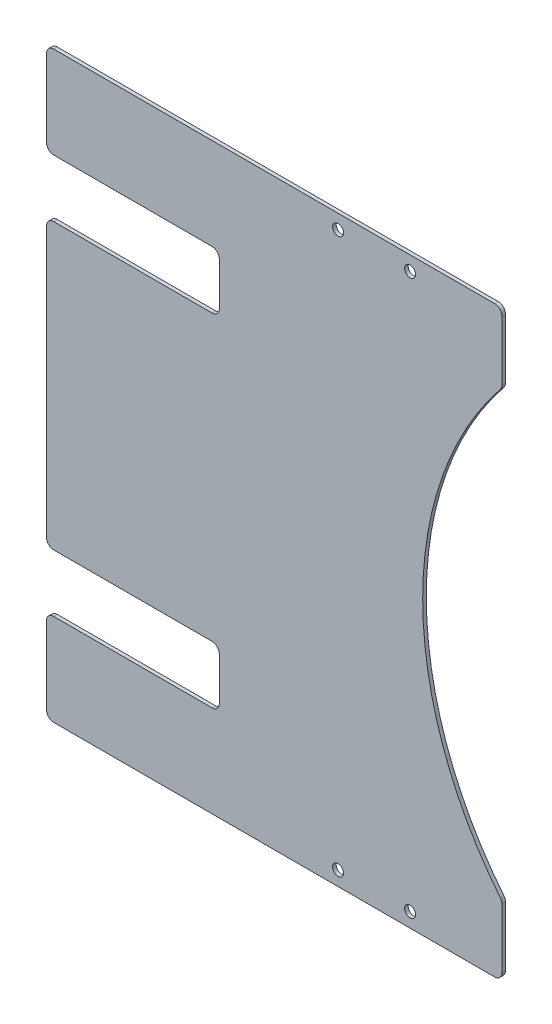
ISO-10303-21;
HEADER;
FILE_DESCRIPTION(('STEP AP214'),'2;1');
FILE_NAME('part.step','',(''),(''),'','','');
FILE_SCHEMA(('AUTOMOTIVE_DESIGN { 1 0 10303 214 1 1 1 1 }'));
ENDSEC;
DATA;
#1=APPLICATION_CONTEXT('core data for automotive mechanical design processes');
#2=APPLICATION_PROTOCOL_DEFINITION('international standard','automotive_design',2000,#1);
#3=PRODUCT_CONTEXT('',#1,'mechanical');
#4=PRODUCT('Part','Part','',(#3));
#5=PRODUCT_RELATED_PRODUCT_CATEGORY('part','',(#4));
#6=PRODUCT_DEFINITION_FORMATION('','',#4);
#7=PRODUCT_DEFINITION_CONTEXT('part definition',#1,'design');
#8=PRODUCT_DEFINITION('design','',#6,#7);
#9=PRODUCT_DEFINITION_SHAPE('','',#8);
#10=(LENGTH_UNIT() NAMED_UNIT(*) SI_UNIT(.MILLI.,.METRE.));
#11=(NAMED_UNIT(*) PLANE_ANGLE_UNIT() SI_UNIT($,.RADIAN.));
#12=(NAMED_UNIT(*) SI_UNIT($,.STERADIAN.) SOLID_ANGLE_UNIT());
#13=UNCERTAINTY_MEASURE_WITH_UNIT(LENGTH_MEASURE(1.E-05),#10,'distance_accuracy_value','');
#14=(GEOMETRIC_REPRESENTATION_CONTEXT(3) GLOBAL_UNCERTAINTY_ASSIGNED_CONTEXT((#13)) GLOBAL_UNIT_ASSIGNED_CONTEXT((#10,
#11,#12)) REPRESENTATION_CONTEXT('',''));
#15=CARTESIAN_POINT('',(0.,0.,0.));
#16=DIRECTION('',(0.,0.,1.));
#17=DIRECTION('',(1.,0.,0.));
#18=AXIS2_PLACEMENT_3D('',#15,#16,#17);
#19=CARTESIAN_POINT('',(35.5,-81.,1.));
#20=DIRECTION('',(-1.,0.,0.));
#21=DIRECTION('',(0.,0.,1.));
#22=AXIS2_PLACEMENT_3D('',#19,#20,#21);
#23=PLANE('',#22);
#24=DIRECTION('',(0.,1.,0.));
#25=VECTOR('',#24,1.);
#26=CARTESIAN_POINT('',(35.5,-81.,0.));
#27=LINE('',#26,#25);
#28=CARTESIAN_POINT('',(35.5,62.4019230472905,0.));
#29=VERTEX_POINT('',#28);
#30=CARTESIAN_POINT('',(35.5,79.,0.));
#31=VERTEX_POINT('',#30);
#32=EDGE_CURVE('E253',#29,#31,#27,.T.);
#33=ORIENTED_EDGE('',*,*,#32,.T.);
#34=DIRECTION('',(0.,0.,-1.));
#35=VECTOR('',#34,1.);
#36=CARTESIAN_POINT('',(35.5,79.,1.));
#37=LINE('',#36,#35);
#38=CARTESIAN_POINT('',(35.5,79.,1.));
#39=VERTEX_POINT('',#38);
#40=EDGE_CURVE('E286',#31,#39,#37,.F.);
#41=ORIENTED_EDGE('',*,*,#40,.T.);
#42=DIRECTION('',(0.,1.,0.));
#43=VECTOR('',#42,1.);
#44=CARTESIAN_POINT('',(35.5,-81.,1.));
#45=LINE('',#44,#43);
#46=CARTESIAN_POINT('',(35.5,62.4019230472905,1.));
#47=VERTEX_POINT('',#46);
#48=EDGE_CURVE('E265',#47,#39,#45,.T.);
#49=ORIENTED_EDGE('',*,*,#48,.F.);
#50=DIRECTION('',(0.,0.,-1.));
#51=VECTOR('',#50,1.);
#52=CARTESIAN_POINT('',(35.5,62.4019230472905,1.));
#53=LINE('',#52,#51);
#54=EDGE_CURVE('E283',#47,#29,#53,.T.);
#55=ORIENTED_EDGE('',*,*,#54,.T.);
#56=EDGE_LOOP('',(#33,#41,#49,#55));
#57=FACE_BOUND('',#56,.T.);
#58=ADVANCED_FACE('F37',(#57),#23,.F.);
#59=CARTESIAN_POINT('',(0.,0.,1.));
#60=DIRECTION('',(0.,0.,-1.));
#61=DIRECTION('',(-1.,0.,0.));
#62=AXIS2_PLACEMENT_3D('',#59,#60,#61);
#63=PLANE('',#62);
#64=DIRECTION('',(1.,0.,0.));
#65=VECTOR('',#64,1.);
#66=CARTESIAN_POINT('',(0.,55.5,1.));
#67=LINE('',#66,#65);
#68=CARTESIAN_POINT('',(-89.,55.5,1.));
#69=VERTEX_POINT('',#68);
#70=CARTESIAN_POINT('',(-45.,55.5,1.));
#71=VERTEX_POINT('',#70);
#72=EDGE_CURVE('E403',#69,#71,#67,.T.);
#73=ORIENTED_EDGE('',*,*,#72,.T.);
#74=CARTESIAN_POINT('',(-45.,53.5,1.));
#75=DIRECTION('',(0.,0.,-1.));
#76=DIRECTION('',(-1.,0.,0.));
#77=AXIS2_PLACEMENT_3D('',#74,#75,#76);
#78=CIRCLE('',#77,2.);
#79=CARTESIAN_POINT('',(-43.,53.5,1.));
#80=VERTEX_POINT('',#79);
#81=EDGE_CURVE('E379',#71,#80,#78,.T.);
#82=ORIENTED_EDGE('',*,*,#81,.T.);
#83=DIRECTION('',(0.,1.,0.));
#84=VECTOR('',#83,1.);
#85=CARTESIAN_POINT('',(-43.,55.5,1.));
#86=LINE('',#85,#84);
#87=CARTESIAN_POINT('',(-43.,41.5,1.));
#88=VERTEX_POINT('',#87);
#89=EDGE_CURVE('E402',#88,#80,#86,.T.);
#90=ORIENTED_EDGE('',*,*,#89,.F.);
#91=CARTESIAN_POINT('',(-45.,41.5,1.));
#92=DIRECTION('',(0.,0.,-1.));
#93=DIRECTION('',(-1.,0.,0.));
#94=AXIS2_PLACEMENT_3D('',#91,#92,#93);
#95=CIRCLE('',#94,2.);
#96=CARTESIAN_POINT('',(-45.,39.5,1.));
#97=VERTEX_POINT('',#96);
#98=EDGE_CURVE('E45',#88,#97,#95,.T.);
#99=ORIENTED_EDGE('',*,*,#98,.T.);
#100=DIRECTION('',(1.,0.,0.));
#101=VECTOR('',#100,1.);
#102=CARTESIAN_POINT('',(0.,39.5,1.));
#103=LINE('',#102,#101);
#104=CARTESIAN_POINT('',(-89.,39.5,1.));
#105=VERTEX_POINT('',#104);
#106=EDGE_CURVE('E425',#105,#97,#103,.T.);
#107=ORIENTED_EDGE('',*,*,#106,.F.);
#108=CARTESIAN_POINT('',(-89.,37.5,1.));
#109=DIRECTION('',(0.,0.,-1.));
#110=DIRECTION('',(-1.,0.,0.));
#111=AXIS2_PLACEMENT_3D('',#108,#109,#110);
#112=CIRCLE('',#111,2.);
#113=CARTESIAN_POINT('',(-91.,37.5,1.));
#114=VERTEX_POINT('',#113);
#115=EDGE_CURVE('E300',#105,#114,#112,.F.);
#116=ORIENTED_EDGE('',*,*,#115,.T.);
#117=DIRECTION('',(0.,-1.,0.));
#118=VECTOR('',#117,1.);
#119=CARTESIAN_POINT('',(-91.,0.,1.));
#120=LINE('',#119,#118);
#121=CARTESIAN_POINT('',(-91.,-37.5,1.));
#122=VERTEX_POINT('',#121);
#123=EDGE_CURVE('E432',#114,#122,#120,.T.);
#124=ORIENTED_EDGE('',*,*,#123,.T.);
#125=CARTESIAN_POINT('',(-89.,-37.5,1.));
#126=DIRECTION('',(0.,0.,-1.));
#127=DIRECTION('',(-1.,0.,0.));
#128=AXIS2_PLACEMENT_3D('',#125,#126,#127);
#129=CIRCLE('',#128,2.);
#130=CARTESIAN_POINT('',(-89.,-39.5,1.));
#131=VERTEX_POINT('',#130);
#132=EDGE_CURVE('E310',#122,#131,#129,.F.);
#133=ORIENTED_EDGE('',*,*,#132,.T.);
#134=DIRECTION('',(1.,0.,0.));
#135=VECTOR('',#134,1.);
#136=CARTESIAN_POINT('',(0.,-39.5,1.));
#137=LINE('',#136,#135);
#138=CARTESIAN_POINT('',(-45.,-39.5,1.));
#139=VERTEX_POINT('',#138);
#140=EDGE_CURVE('E429',#131,#139,#137,.T.);
#141=ORIENTED_EDGE('',*,*,#140,.T.);
#142=CARTESIAN_POINT('',(-45.,-41.5,1.));
#143=DIRECTION('',(0.,0.,-1.));
#144=DIRECTION('',(-1.,0.,0.));
#145=AXIS2_PLACEMENT_3D('',#142,#143,#144);
#146=CIRCLE('',#145,2.);
#147=CARTESIAN_POINT('',(-43.,-41.5,1.));
#148=VERTEX_POINT('',#147);
#149=EDGE_CURVE('E371',#139,#148,#146,.T.);
#150=ORIENTED_EDGE('',*,*,#149,.T.);
#151=DIRECTION('',(0.,1.,0.));
#152=VECTOR('',#151,1.);
#153=CARTESIAN_POINT('',(-43.,-39.5,1.));
#154=LINE('',#153,#152);
#155=CARTESIAN_POINT('',(-43.,-53.5,1.));
#156=VERTEX_POINT('',#155);
#157=EDGE_CURVE('E408',#156,#148,#154,.T.);
#158=ORIENTED_EDGE('',*,*,#157,.F.);
#159=CARTESIAN_POINT('',(-45.,-53.5,1.));
#160=DIRECTION('',(0.,0.,-1.));
#161=DIRECTION('',(-1.,0.,0.));
#162=AXIS2_PLACEMENT_3D('',#159,#160,#161);
#163=CIRCLE('',#162,2.);
#164=CARTESIAN_POINT('',(-45.,-55.5,1.));
#165=VERTEX_POINT('',#164);
#166=EDGE_CURVE('E375',#156,#165,#163,.T.);
#167=ORIENTED_EDGE('',*,*,#166,.T.);
#168=DIRECTION('',(1.,0.,0.));
#169=VECTOR('',#168,1.);
#170=CARTESIAN_POINT('',(0.,-55.5,1.));
#171=LINE('',#170,#169);
#172=CARTESIAN_POINT('',(-89.,-55.5,1.));
#173=VERTEX_POINT('',#172);
#174=EDGE_CURVE('E419',#173,#165,#171,.T.);
#175=ORIENTED_EDGE('',*,*,#174,.F.);
#176=CARTESIAN_POINT('',(-89.,-57.5,1.));
#177=DIRECTION('',(0.,0.,-1.));
#178=DIRECTION('',(-1.,0.,0.));
#179=AXIS2_PLACEMENT_3D('',#176,#177,#178);
#180=CIRCLE('',#179,2.);
#181=CARTESIAN_POINT('',(-91.,-57.5,1.));
#182=VERTEX_POINT('',#181);
#183=EDGE_CURVE('E308',#173,#182,#180,.F.);
#184=ORIENTED_EDGE('',*,*,#183,.T.);
#185=DIRECTION('',(0.,-1.,0.));
#186=VECTOR('',#185,1.);
#187=CARTESIAN_POINT('',(-91.,0.,1.));
#188=LINE('',#187,#186);
#189=CARTESIAN_POINT('',(-91.,-79.,1.));
#190=VERTEX_POINT('',#189);
#191=EDGE_CURVE('E411',#182,#190,#188,.T.);
#192=ORIENTED_EDGE('',*,*,#191,.T.);
#193=CARTESIAN_POINT('',(-89.,-79.,1.));
#194=DIRECTION('',(0.,0.,-1.));
#195=DIRECTION('',(-1.,0.,0.));
#196=AXIS2_PLACEMENT_3D('',#193,#194,#195);
#197=CIRCLE('',#196,2.);
#198=CARTESIAN_POINT('',(-89.,-81.,1.));
#199=VERTEX_POINT('',#198);
#200=EDGE_CURVE('E306',#190,#199,#197,.F.);
#201=ORIENTED_EDGE('',*,*,#200,.T.);
#202=DIRECTION('',(1.,0.,0.));
#203=VECTOR('',#202,1.);
#204=CARTESIAN_POINT('',(-45.,-81.,1.));
#205=LINE('',#204,#203);
#206=CARTESIAN_POINT('',(33.5,-81.,1.));
#207=VERTEX_POINT('',#206);
#208=EDGE_CURVE('E261',#199,#207,#205,.T.);
#209=ORIENTED_EDGE('',*,*,#208,.T.);
#210=CARTESIAN_POINT('',(33.5,-79.,1.));
#211=DIRECTION('',(0.,0.,-1.));
#212=DIRECTION('',(-1.,0.,0.));
#213=AXIS2_PLACEMENT_3D('',#210,#211,#212);
#214=CIRCLE('',#213,2.);
#215=CARTESIAN_POINT('',(35.5,-79.,1.));
#216=VERTEX_POINT('',#215);
#217=EDGE_CURVE('E278',#207,#216,#214,.F.);
#218=ORIENTED_EDGE('',*,*,#217,.T.);
#219=CARTESIAN_POINT('',(35.5,-62.4019230472906,1.));
#220=VERTEX_POINT('',#219);
#221=EDGE_CURVE('E243',#216,#220,#45,.T.);
#222=ORIENTED_EDGE('',*,*,#221,.T.);
#223=CARTESIAN_POINT('',(33.5,-62.4019230472906,1.));
#224=DIRECTION('',(0.,0.,-1.));
#225=DIRECTION('',(-1.,0.,0.));
#226=AXIS2_PLACEMENT_3D('',#223,#224,#225);
#227=CIRCLE('',#226,2.);
#228=CARTESIAN_POINT('',(35.0577889447236,-61.1476130362898,1.));
#229=VERTEX_POINT('',#228);
#230=EDGE_CURVE('E272',#220,#229,#227,.F.);
#231=ORIENTED_EDGE('',*,*,#230,.T.);
#232=CARTESIAN_POINT('',(111.,0.,1.));
#233=DIRECTION('',(0.,0.,-1.));
#234=DIRECTION('',(-1.,0.,0.));
#235=AXIS2_PLACEMENT_3D('',#232,#233,#234);
#236=CIRCLE('',#235,97.5);
#237=CARTESIAN_POINT('',(35.0577889447236,61.1476130362897,1.));
#238=VERTEX_POINT('',#237);
#239=EDGE_CURVE('E446',#229,#238,#236,.T.);
#240=ORIENTED_EDGE('',*,*,#239,.T.);
#241=CARTESIAN_POINT('',(33.5,62.4019230472906,1.));
#242=DIRECTION('',(0.,0.,-1.));
#243=DIRECTION('',(-1.,0.,0.));
#244=AXIS2_PLACEMENT_3D('',#241,#242,#243);
#245=CIRCLE('',#244,2.);
#246=EDGE_CURVE('E274',#238,#47,#245,.F.);
#247=ORIENTED_EDGE('',*,*,#246,.T.);
#248=ORIENTED_EDGE('',*,*,#48,.T.);
#249=CARTESIAN_POINT('',(33.5,79.,1.));
#250=DIRECTION('',(0.,0.,-1.));
#251=DIRECTION('',(-1.,0.,0.));
#252=AXIS2_PLACEMENT_3D('',#249,#250,#251);
#253=CIRCLE('',#252,2.);
#254=CARTESIAN_POINT('',(33.5,81.,1.));
#255=VERTEX_POINT('',#254);
#256=EDGE_CURVE('E276',#39,#255,#253,.F.);
#257=ORIENTED_EDGE('',*,*,#256,.T.);
#258=DIRECTION('',(-1.,0.,0.));
#259=VECTOR('',#258,1.);
#260=CARTESIAN_POINT('',(-45.,81.,1.));
#261=LINE('',#260,#259);
#262=CARTESIAN_POINT('',(-89.,81.,1.));
#263=VERTEX_POINT('',#262);
#264=EDGE_CURVE('E475',#255,#263,#261,.T.);
#265=ORIENTED_EDGE('',*,*,#264,.T.);
#266=CARTESIAN_POINT('',(-89.,79.,1.));
#267=DIRECTION('',(0.,0.,-1.));
#268=DIRECTION('',(-1.,0.,0.));
#269=AXIS2_PLACEMENT_3D('',#266,#267,#268);
#270=CIRCLE('',#269,2.);
#271=CARTESIAN_POINT('',(-91.,79.,1.));
#272=VERTEX_POINT('',#271);
#273=EDGE_CURVE('E304',#263,#272,#270,.F.);
#274=ORIENTED_EDGE('',*,*,#273,.T.);
#275=DIRECTION('',(0.,-1.,0.));
#276=VECTOR('',#275,1.);
#277=CARTESIAN_POINT('',(-91.,0.,1.));
#278=LINE('',#277,#276);
#279=CARTESIAN_POINT('',(-91.,57.5,1.));
#280=VERTEX_POINT('',#279);
#281=EDGE_CURVE('E439',#272,#280,#278,.T.);
#282=ORIENTED_EDGE('',*,*,#281,.T.);
#283=CARTESIAN_POINT('',(-89.,57.5,1.));
#284=DIRECTION('',(0.,0.,-1.));
#285=DIRECTION('',(-1.,0.,0.));
#286=AXIS2_PLACEMENT_3D('',#283,#284,#285);
#287=CIRCLE('',#286,2.);
#288=EDGE_CURVE('E302',#280,#69,#287,.F.);
#289=ORIENTED_EDGE('',*,*,#288,.T.);
#290=EDGE_LOOP('',(#73,#82,#90,#99,#107,#116,#124,#133,#141,#150,#158,#167,#175,#184,#192,#201,
#209,#218,#222,#231,#240,#247,#248,#257,#265,#274,#282,#289));
#291=FACE_BOUND('',#290,.T.);
#292=CARTESIAN_POINT('',(-9.99999999999997,76.9999999999999,1.));
#293=DIRECTION('',(0.,0.,1.));
#294=DIRECTION('',(1.,0.,0.));
#295=AXIS2_PLACEMENT_3D('',#292,#293,#294);
#296=CIRCLE('',#295,1.525);
#297=CARTESIAN_POINT('',(-8.47499999999997,76.9999999999999,1.));
#298=VERTEX_POINT('',#297);
#299=EDGE_CURVE('E259',#298,#298,#296,.T.);
#300=ORIENTED_EDGE('',*,*,#299,.F.);
#301=EDGE_LOOP('',(#300));
#302=FACE_BOUND('',#301,.T.);
#303=CARTESIAN_POINT('',(10.,76.9999999999999,1.));
#304=DIRECTION('',(0.,0.,1.));
#305=DIRECTION('',(1.,0.,0.));
#306=AXIS2_PLACEMENT_3D('',#303,#304,#305);
#307=CIRCLE('',#306,1.525);
#308=CARTESIAN_POINT('',(11.525,76.9999999999999,1.));
#309=VERTEX_POINT('',#308);
#310=EDGE_CURVE('E464',#309,#309,#307,.T.);
#311=ORIENTED_EDGE('',*,*,#310,.F.);
#312=EDGE_LOOP('',(#311));
#313=FACE_BOUND('',#312,.T.);
#314=CARTESIAN_POINT('',(-9.99999999999997,-77.0000000000001,1.));
#315=DIRECTION('',(0.,0.,1.));
#316=DIRECTION('',(1.,0.,0.));
#317=AXIS2_PLACEMENT_3D('',#314,#315,#316);
#318=CIRCLE('',#317,1.525);
#319=CARTESIAN_POINT('',(-8.47499999999997,-77.0000000000001,1.));
#320=VERTEX_POINT('',#319);
#321=EDGE_CURVE('E458',#320,#320,#318,.T.);
#322=ORIENTED_EDGE('',*,*,#321,.F.);
#323=EDGE_LOOP('',(#322));
#324=FACE_BOUND('',#323,.T.);
#325=CARTESIAN_POINT('',(10.,-77.0000000000001,1.));
#326=DIRECTION('',(0.,0.,1.));
#327=DIRECTION('',(1.,0.,0.));
#328=AXIS2_PLACEMENT_3D('',#325,#326,#327);
#329=CIRCLE('',#328,1.525);
#330=CARTESIAN_POINT('',(11.525,-77.0000000000001,1.));
#331=VERTEX_POINT('',#330);
#332=EDGE_CURVE('E452',#331,#331,#329,.T.);
#333=ORIENTED_EDGE('',*,*,#332,.F.);
#334=EDGE_LOOP('',(#333));
#335=FACE_BOUND('',#334,.T.);
#336=ADVANCED_FACE('F400',(#291,#302,#313,#324,#335),#63,.F.);
#337=CARTESIAN_POINT('',(0.,0.,0.));
#338=DIRECTION('',(0.,0.,-1.));
#339=DIRECTION('',(-1.,0.,0.));
#340=AXIS2_PLACEMENT_3D('',#337,#338,#339);
#341=PLANE('',#340);
#342=DIRECTION('',(0.,-1.,0.));
#343=VECTOR('',#342,1.);
#344=CARTESIAN_POINT('',(-43.,0.,0.));
#345=LINE('',#344,#343);
#346=CARTESIAN_POINT('',(-43.,53.5,0.));
#347=VERTEX_POINT('',#346);
#348=CARTESIAN_POINT('',(-43.,41.5,0.));
#349=VERTEX_POINT('',#348);
#350=EDGE_CURVE('E349',#347,#349,#345,.T.);
#351=ORIENTED_EDGE('',*,*,#350,.F.);
#352=CARTESIAN_POINT('',(-45.,53.5,0.));
#353=DIRECTION('',(0.,0.,-1.));
#354=DIRECTION('',(-1.,0.,0.));
#355=AXIS2_PLACEMENT_3D('',#352,#353,#354);
#356=CIRCLE('',#355,2.);
#357=CARTESIAN_POINT('',(-45.,55.5,0.));
#358=VERTEX_POINT('',#357);
#359=EDGE_CURVE('E381',#347,#358,#356,.F.);
#360=ORIENTED_EDGE('',*,*,#359,.T.);
#361=DIRECTION('',(1.,0.,0.));
#362=VECTOR('',#361,1.);
#363=CARTESIAN_POINT('',(0.,55.5,0.));
#364=LINE('',#363,#362);
#365=CARTESIAN_POINT('',(-89.,55.5,0.));
#366=VERTEX_POINT('',#365);
#367=EDGE_CURVE('E385',#366,#358,#364,.T.);
#368=ORIENTED_EDGE('',*,*,#367,.F.);
#369=CARTESIAN_POINT('',(-89.,57.5,0.));
#370=DIRECTION('',(0.,0.,-1.));
#371=DIRECTION('',(-1.,0.,0.));
#372=AXIS2_PLACEMENT_3D('',#369,#370,#371);
#373=CIRCLE('',#372,2.);
#374=CARTESIAN_POINT('',(-91.,57.5,0.));
#375=VERTEX_POINT('',#374);
#376=EDGE_CURVE('E316',#366,#375,#373,.T.);
#377=ORIENTED_EDGE('',*,*,#376,.T.);
#378=DIRECTION('',(0.,-1.,0.));
#379=VECTOR('',#378,1.);
#380=CARTESIAN_POINT('',(-91.,0.,0.));
#381=LINE('',#380,#379);
#382=CARTESIAN_POINT('',(-91.,79.,0.));
#383=VERTEX_POINT('',#382);
#384=EDGE_CURVE('E396',#383,#375,#381,.T.);
#385=ORIENTED_EDGE('',*,*,#384,.F.);
#386=CARTESIAN_POINT('',(-89.,79.,0.));
#387=DIRECTION('',(0.,0.,-1.));
#388=DIRECTION('',(-1.,0.,0.));
#389=AXIS2_PLACEMENT_3D('',#386,#387,#388);
#390=CIRCLE('',#389,2.);
#391=CARTESIAN_POINT('',(-89.,81.,0.));
#392=VERTEX_POINT('',#391);
#393=EDGE_CURVE('E318',#383,#392,#390,.T.);
#394=ORIENTED_EDGE('',*,*,#393,.T.);
#395=DIRECTION('',(-1.,0.,0.));
#396=VECTOR('',#395,1.);
#397=CARTESIAN_POINT('',(-45.,81.,0.));
#398=LINE('',#397,#396);
#399=CARTESIAN_POINT('',(33.5,81.,0.));
#400=VERTEX_POINT('',#399);
#401=EDGE_CURVE('E252',#400,#392,#398,.T.);
#402=ORIENTED_EDGE('',*,*,#401,.F.);
#403=CARTESIAN_POINT('',(33.5,79.,0.));
#404=DIRECTION('',(0.,0.,-1.));
#405=DIRECTION('',(-1.,0.,0.));
#406=AXIS2_PLACEMENT_3D('',#403,#404,#405);
#407=CIRCLE('',#406,2.);
#408=EDGE_CURVE('E233',#400,#31,#407,.T.);
#409=ORIENTED_EDGE('',*,*,#408,.T.);
#410=ORIENTED_EDGE('',*,*,#32,.F.);
#411=CARTESIAN_POINT('',(33.5,62.4019230472906,0.));
#412=DIRECTION('',(0.,0.,-1.));
#413=DIRECTION('',(-1.,0.,0.));
#414=AXIS2_PLACEMENT_3D('',#411,#412,#413);
#415=CIRCLE('',#414,2.);
#416=CARTESIAN_POINT('',(35.0577889447236,61.1476130362897,0.));
#417=VERTEX_POINT('',#416);
#418=EDGE_CURVE('E268',#29,#417,#415,.T.);
#419=ORIENTED_EDGE('',*,*,#418,.T.);
#420=CARTESIAN_POINT('',(111.,0.,0.));
#421=DIRECTION('',(0.,0.,-1.));
#422=DIRECTION('',(-1.,0.,0.));
#423=AXIS2_PLACEMENT_3D('',#420,#421,#422);
#424=CIRCLE('',#423,97.5);
#425=CARTESIAN_POINT('',(35.0577889447236,-61.1476130362898,0.));
#426=VERTEX_POINT('',#425);
#427=EDGE_CURVE('E395',#426,#417,#424,.T.);
#428=ORIENTED_EDGE('',*,*,#427,.F.);
#429=CARTESIAN_POINT('',(33.5,-62.4019230472906,0.));
#430=DIRECTION('',(0.,0.,-1.));
#431=DIRECTION('',(-1.,0.,0.));
#432=AXIS2_PLACEMENT_3D('',#429,#430,#431);
#433=CIRCLE('',#432,2.);
#434=CARTESIAN_POINT('',(35.5,-62.4019230472906,0.));
#435=VERTEX_POINT('',#434);
#436=EDGE_CURVE('E244',#426,#435,#433,.T.);
#437=ORIENTED_EDGE('',*,*,#436,.T.);
#438=CARTESIAN_POINT('',(35.5,-79.,0.));
#439=VERTEX_POINT('',#438);
#440=EDGE_CURVE('E240',#439,#435,#27,.T.);
#441=ORIENTED_EDGE('',*,*,#440,.F.);
#442=CARTESIAN_POINT('',(33.5,-79.,0.));
#443=DIRECTION('',(0.,0.,-1.));
#444=DIRECTION('',(-1.,0.,0.));
#445=AXIS2_PLACEMENT_3D('',#442,#443,#444);
#446=CIRCLE('',#445,2.);
#447=CARTESIAN_POINT('',(33.5,-81.,0.));
#448=VERTEX_POINT('',#447);
#449=EDGE_CURVE('E223',#439,#448,#446,.T.);
#450=ORIENTED_EDGE('',*,*,#449,.T.);
#451=DIRECTION('',(1.,0.,0.));
#452=VECTOR('',#451,1.);
#453=CARTESIAN_POINT('',(-45.,-81.,0.));
#454=LINE('',#453,#452);
#455=CARTESIAN_POINT('',(-89.,-81.,0.));
#456=VERTEX_POINT('',#455);
#457=EDGE_CURVE('E256',#456,#448,#454,.T.);
#458=ORIENTED_EDGE('',*,*,#457,.F.);
#459=CARTESIAN_POINT('',(-89.,-79.,0.));
#460=DIRECTION('',(0.,0.,-1.));
#461=DIRECTION('',(-1.,0.,0.));
#462=AXIS2_PLACEMENT_3D('',#459,#460,#461);
#463=CIRCLE('',#462,2.);
#464=CARTESIAN_POINT('',(-91.,-79.,0.));
#465=VERTEX_POINT('',#464);
#466=EDGE_CURVE('E320',#456,#465,#463,.T.);
#467=ORIENTED_EDGE('',*,*,#466,.T.);
#468=DIRECTION('',(0.,-1.,0.));
#469=VECTOR('',#468,1.);
#470=CARTESIAN_POINT('',(-91.,0.,0.));
#471=LINE('',#470,#469);
#472=CARTESIAN_POINT('',(-91.,-57.5,0.));
#473=VERTEX_POINT('',#472);
#474=EDGE_CURVE('E418',#473,#465,#471,.T.);
#475=ORIENTED_EDGE('',*,*,#474,.F.);
#476=CARTESIAN_POINT('',(-89.,-57.5,0.));
#477=DIRECTION('',(0.,0.,-1.));
#478=DIRECTION('',(-1.,0.,0.));
#479=AXIS2_PLACEMENT_3D('',#476,#477,#478);
#480=CIRCLE('',#479,2.);
#481=CARTESIAN_POINT('',(-89.,-55.5,0.));
#482=VERTEX_POINT('',#481);
#483=EDGE_CURVE('E322',#473,#482,#480,.T.);
#484=ORIENTED_EDGE('',*,*,#483,.T.);
#485=DIRECTION('',(1.,0.,0.));
#486=VECTOR('',#485,1.);
#487=CARTESIAN_POINT('',(0.,-55.5,0.));
#488=LINE('',#487,#486);
#489=CARTESIAN_POINT('',(-45.,-55.5,0.));
#490=VERTEX_POINT('',#489);
#491=EDGE_CURVE('E407',#482,#490,#488,.T.);
#492=ORIENTED_EDGE('',*,*,#491,.T.);
#493=CARTESIAN_POINT('',(-45.,-53.5,0.));
#494=DIRECTION('',(0.,0.,-1.));
#495=DIRECTION('',(-1.,0.,0.));
#496=AXIS2_PLACEMENT_3D('',#493,#494,#495);
#497=CIRCLE('',#496,2.);
#498=CARTESIAN_POINT('',(-43.,-53.5,0.));
#499=VERTEX_POINT('',#498);
#500=EDGE_CURVE('E377',#490,#499,#497,.F.);
#501=ORIENTED_EDGE('',*,*,#500,.T.);
#502=DIRECTION('',(0.,-1.,0.));
#503=VECTOR('',#502,1.);
#504=CARTESIAN_POINT('',(-43.,0.,0.));
#505=LINE('',#504,#503);
#506=CARTESIAN_POINT('',(-43.,-41.5,0.));
#507=VERTEX_POINT('',#506);
#508=EDGE_CURVE('E346',#507,#499,#505,.T.);
#509=ORIENTED_EDGE('',*,*,#508,.F.);
#510=CARTESIAN_POINT('',(-45.,-41.5,0.));
#511=DIRECTION('',(0.,0.,-1.));
#512=DIRECTION('',(-1.,0.,0.));
#513=AXIS2_PLACEMENT_3D('',#510,#511,#512);
#514=CIRCLE('',#513,2.);
#515=CARTESIAN_POINT('',(-45.,-39.5,0.));
#516=VERTEX_POINT('',#515);
#517=EDGE_CURVE('E373',#507,#516,#514,.F.);
#518=ORIENTED_EDGE('',*,*,#517,.T.);
#519=DIRECTION('',(1.,0.,0.));
#520=VECTOR('',#519,1.);
#521=CARTESIAN_POINT('',(0.,-39.5,0.));
#522=LINE('',#521,#520);
#523=CARTESIAN_POINT('',(-89.,-39.5,0.));
#524=VERTEX_POINT('',#523);
#525=EDGE_CURVE('E428',#524,#516,#522,.T.);
#526=ORIENTED_EDGE('',*,*,#525,.F.);
#527=CARTESIAN_POINT('',(-89.,-37.5,0.));
#528=DIRECTION('',(0.,0.,-1.));
#529=DIRECTION('',(-1.,0.,0.));
#530=AXIS2_PLACEMENT_3D('',#527,#528,#529);
#531=CIRCLE('',#530,2.);
#532=CARTESIAN_POINT('',(-91.,-37.5,0.));
#533=VERTEX_POINT('',#532);
#534=EDGE_CURVE('E324',#524,#533,#531,.T.);
#535=ORIENTED_EDGE('',*,*,#534,.T.);
#536=DIRECTION('',(0.,-1.,0.));
#537=VECTOR('',#536,1.);
#538=CARTESIAN_POINT('',(-91.,0.,0.));
#539=LINE('',#538,#537);
#540=CARTESIAN_POINT('',(-91.,37.5,0.));
#541=VERTEX_POINT('',#540);
#542=EDGE_CURVE('E427',#541,#533,#539,.T.);
#543=ORIENTED_EDGE('',*,*,#542,.F.);
#544=CARTESIAN_POINT('',(-89.,37.5,0.));
#545=DIRECTION('',(0.,0.,-1.));
#546=DIRECTION('',(-1.,0.,0.));
#547=AXIS2_PLACEMENT_3D('',#544,#545,#546);
#548=CIRCLE('',#547,2.);
#549=CARTESIAN_POINT('',(-89.,39.5,0.));
#550=VERTEX_POINT('',#549);
#551=EDGE_CURVE('E314',#541,#550,#548,.T.);
#552=ORIENTED_EDGE('',*,*,#551,.T.);
#553=DIRECTION('',(1.,0.,0.));
#554=VECTOR('',#553,1.);
#555=CARTESIAN_POINT('',(0.,39.5,0.));
#556=LINE('',#555,#554);
#557=CARTESIAN_POINT('',(-45.,39.5,0.));
#558=VERTEX_POINT('',#557);
#559=EDGE_CURVE('E422',#550,#558,#556,.T.);
#560=ORIENTED_EDGE('',*,*,#559,.T.);
#561=CARTESIAN_POINT('',(-45.,41.5,0.));
#562=DIRECTION('',(0.,0.,-1.));
#563=DIRECTION('',(-1.,0.,0.));
#564=AXIS2_PLACEMENT_3D('',#561,#562,#563);
#565=CIRCLE('',#564,2.);
#566=EDGE_CURVE('E11',#558,#349,#565,.F.);
#567=ORIENTED_EDGE('',*,*,#566,.T.);
#568=EDGE_LOOP('',(#351,#360,#368,#377,#385,#394,#402,#409,#410,#419,#428,#437,#441,#450,#458,
#467,#475,#484,#492,#501,#509,#518,#526,#535,#543,#552,#560,#567));
#569=FACE_BOUND('',#568,.T.);
#570=CARTESIAN_POINT('',(-9.99999999999997,-77.0000000000001,0.));
#571=DIRECTION('',(0.,0.,1.));
#572=DIRECTION('',(1.,0.,0.));
#573=AXIS2_PLACEMENT_3D('',#570,#571,#572);
#574=CIRCLE('',#573,1.525);
#575=CARTESIAN_POINT('',(-8.47499999999997,-77.0000000000001,0.));
#576=VERTEX_POINT('',#575);
#577=EDGE_CURVE('E455',#576,#576,#574,.T.);
#578=ORIENTED_EDGE('',*,*,#577,.T.);
#579=EDGE_LOOP('',(#578));
#580=FACE_BOUND('',#579,.T.);
#581=CARTESIAN_POINT('',(-9.99999999999997,76.9999999999999,0.));
#582=DIRECTION('',(0.,0.,1.));
#583=DIRECTION('',(1.,0.,0.));
#584=AXIS2_PLACEMENT_3D('',#581,#582,#583);
#585=CIRCLE('',#584,1.525);
#586=CARTESIAN_POINT('',(-8.47499999999997,76.9999999999999,0.));
#587=VERTEX_POINT('',#586);
#588=EDGE_CURVE('E467',#587,#587,#585,.T.);
#589=ORIENTED_EDGE('',*,*,#588,.T.);
#590=EDGE_LOOP('',(#589));
#591=FACE_BOUND('',#590,.T.);
#592=CARTESIAN_POINT('',(10.,76.9999999999999,0.));
#593=DIRECTION('',(0.,0.,1.));
#594=DIRECTION('',(1.,0.,0.));
#595=AXIS2_PLACEMENT_3D('',#592,#593,#594);
#596=CIRCLE('',#595,1.525);
#597=CARTESIAN_POINT('',(11.525,76.9999999999999,0.));
#598=VERTEX_POINT('',#597);
#599=EDGE_CURVE('E461',#598,#598,#596,.T.);
#600=ORIENTED_EDGE('',*,*,#599,.T.);
#601=EDGE_LOOP('',(#600));
#602=FACE_BOUND('',#601,.T.);
#603=CARTESIAN_POINT('',(10.,-77.0000000000001,0.));
#604=DIRECTION('',(0.,0.,1.));
#605=DIRECTION('',(1.,0.,0.));
#606=AXIS2_PLACEMENT_3D('',#603,#604,#605);
#607=CIRCLE('',#606,1.525);
#608=CARTESIAN_POINT('',(11.525,-77.0000000000001,0.));
#609=VERTEX_POINT('',#608);
#610=EDGE_CURVE('E449',#609,#609,#607,.T.);
#611=ORIENTED_EDGE('',*,*,#610,.T.);
#612=EDGE_LOOP('',(#611));
#613=FACE_BOUND('',#612,.T.);
#614=ADVANCED_FACE('F248',(#569,#580,#591,#602,#613),#341,.T.);
#615=ORIENTED_EDGE('',*,*,#221,.F.);
#616=DIRECTION('',(0.,0.,-1.));
#617=VECTOR('',#616,1.);
#618=CARTESIAN_POINT('',(35.5,-79.,1.));
#619=LINE('',#618,#617);
#620=EDGE_CURVE('E227',#216,#439,#619,.T.);
#621=ORIENTED_EDGE('',*,*,#620,.T.);
#622=ORIENTED_EDGE('',*,*,#440,.T.);
#623=DIRECTION('',(0.,0.,-1.));
#624=VECTOR('',#623,1.);
#625=CARTESIAN_POINT('',(35.5,-62.4019230472906,1.));
#626=LINE('',#625,#624);
#627=EDGE_CURVE('E245',#435,#220,#626,.F.);
#628=ORIENTED_EDGE('',*,*,#627,.T.);
#629=EDGE_LOOP('',(#615,#621,#622,#628));
#630=FACE_BOUND('',#629,.T.);
#631=ADVANCED_FACE('F238',(#630),#23,.F.);
#632=CARTESIAN_POINT('',(-45.,81.,1.));
#633=DIRECTION('',(0.,-1.,0.));
#634=DIRECTION('',(0.,0.,-1.));
#635=AXIS2_PLACEMENT_3D('',#632,#633,#634);
#636=PLANE('',#635);
#637=ORIENTED_EDGE('',*,*,#401,.T.);
#638=DIRECTION('',(0.,0.,1.));
#639=VECTOR('',#638,1.);
#640=CARTESIAN_POINT('',(-89.,81.,1.));
#641=LINE('',#640,#639);
#642=EDGE_CURVE('E336',#392,#263,#641,.T.);
#643=ORIENTED_EDGE('',*,*,#642,.T.);
#644=ORIENTED_EDGE('',*,*,#264,.F.);
#645=DIRECTION('',(0.,0.,-1.));
#646=VECTOR('',#645,1.);
#647=CARTESIAN_POINT('',(33.5,81.,1.));
#648=LINE('',#647,#646);
#649=EDGE_CURVE('E280',#255,#400,#648,.T.);
#650=ORIENTED_EDGE('',*,*,#649,.T.);
#651=EDGE_LOOP('',(#637,#643,#644,#650));
#652=FACE_BOUND('',#651,.T.);
#653=ADVANCED_FACE('F549',(#652),#636,.F.);
#654=CARTESIAN_POINT('',(-45.,-81.,1.));
#655=DIRECTION('',(0.,1.,0.));
#656=DIRECTION('',(-1.,0.,0.));
#657=AXIS2_PLACEMENT_3D('',#654,#655,#656);
#658=PLANE('',#657);
#659=ORIENTED_EDGE('',*,*,#208,.F.);
#660=DIRECTION('',(0.,0.,1.));
#661=VECTOR('',#660,1.);
#662=CARTESIAN_POINT('',(-89.,-81.,0.));
#663=LINE('',#662,#661);
#664=EDGE_CURVE('E334',#199,#456,#663,.F.);
#665=ORIENTED_EDGE('',*,*,#664,.T.);
#666=ORIENTED_EDGE('',*,*,#457,.T.);
#667=DIRECTION('',(0.,0.,-1.));
#668=VECTOR('',#667,1.);
#669=CARTESIAN_POINT('',(33.5,-81.,1.));
#670=LINE('',#669,#668);
#671=EDGE_CURVE('E229',#448,#207,#670,.F.);
#672=ORIENTED_EDGE('',*,*,#671,.T.);
#673=EDGE_LOOP('',(#659,#665,#666,#672));
#674=FACE_BOUND('',#673,.T.);
#675=ADVANCED_FACE('F482',(#674),#658,.F.);
#676=CARTESIAN_POINT('',(-9.99999999999997,76.9999999999999,1.));
#677=DIRECTION('',(0.,0.,-1.));
#678=DIRECTION('',(-1.,0.,0.));
#679=AXIS2_PLACEMENT_3D('',#676,#677,#678);
#680=CYLINDRICAL_SURFACE('',#679,1.525);
#681=ORIENTED_EDGE('',*,*,#299,.T.);
#682=EDGE_LOOP('',(#681));
#683=FACE_BOUND('',#682,.T.);
#684=ORIENTED_EDGE('',*,*,#588,.F.);
#685=EDGE_LOOP('',(#684));
#686=FACE_BOUND('',#685,.T.);
#687=ADVANCED_FACE('F561',(#683,#686),#680,.F.);
#688=CARTESIAN_POINT('',(10.,76.9999999999999,1.));
#689=DIRECTION('',(0.,0.,-1.));
#690=DIRECTION('',(-1.,0.,0.));
#691=AXIS2_PLACEMENT_3D('',#688,#689,#690);
#692=CYLINDRICAL_SURFACE('',#691,1.525);
#693=ORIENTED_EDGE('',*,*,#310,.T.);
#694=EDGE_LOOP('',(#693));
#695=FACE_BOUND('',#694,.T.);
#696=ORIENTED_EDGE('',*,*,#599,.F.);
#697=EDGE_LOOP('',(#696));
#698=FACE_BOUND('',#697,.T.);
#699=ADVANCED_FACE('F565',(#695,#698),#692,.F.);
#700=CARTESIAN_POINT('',(-9.99999999999997,-77.0000000000001,1.));
#701=DIRECTION('',(0.,0.,-1.));
#702=DIRECTION('',(-1.,0.,0.));
#703=AXIS2_PLACEMENT_3D('',#700,#701,#702);
#704=CYLINDRICAL_SURFACE('',#703,1.525);
#705=ORIENTED_EDGE('',*,*,#321,.T.);
#706=EDGE_LOOP('',(#705));
#707=FACE_BOUND('',#706,.T.);
#708=ORIENTED_EDGE('',*,*,#577,.F.);
#709=EDGE_LOOP('',(#708));
#710=FACE_BOUND('',#709,.T.);
#711=ADVANCED_FACE('F570',(#707,#710),#704,.F.);
#712=CARTESIAN_POINT('',(10.,-77.0000000000001,1.));
#713=DIRECTION('',(0.,0.,-1.));
#714=DIRECTION('',(-1.,0.,0.));
#715=AXIS2_PLACEMENT_3D('',#712,#713,#714);
#716=CYLINDRICAL_SURFACE('',#715,1.525);
#717=ORIENTED_EDGE('',*,*,#332,.T.);
#718=EDGE_LOOP('',(#717));
#719=FACE_BOUND('',#718,.T.);
#720=ORIENTED_EDGE('',*,*,#610,.F.);
#721=EDGE_LOOP('',(#720));
#722=FACE_BOUND('',#721,.T.);
#723=ADVANCED_FACE('F577',(#719,#722),#716,.F.);
#724=CARTESIAN_POINT('',(111.,0.,1.));
#725=DIRECTION('',(0.,0.,-1.));
#726=DIRECTION('',(-1.,0.,0.));
#727=AXIS2_PLACEMENT_3D('',#724,#725,#726);
#728=CYLINDRICAL_SURFACE('',#727,97.5);
#729=ORIENTED_EDGE('',*,*,#427,.T.);
#730=DIRECTION('',(0.,0.,-1.));
#731=VECTOR('',#730,1.);
#732=CARTESIAN_POINT('',(35.0577889447236,61.1476130362897,1.));
#733=LINE('',#732,#731);
#734=EDGE_CURVE('E290',#417,#238,#733,.F.);
#735=ORIENTED_EDGE('',*,*,#734,.T.);
#736=ORIENTED_EDGE('',*,*,#239,.F.);
#737=DIRECTION('',(0.,0.,-1.));
#738=VECTOR('',#737,1.);
#739=CARTESIAN_POINT('',(35.0577889447236,-61.1476130362898,1.));
#740=LINE('',#739,#738);
#741=EDGE_CURVE('E288',#229,#426,#740,.T.);
#742=ORIENTED_EDGE('',*,*,#741,.T.);
#743=EDGE_LOOP('',(#729,#735,#736,#742));
#744=FACE_BOUND('',#743,.T.);
#745=ADVANCED_FACE('F581',(#744),#728,.F.);
#746=CARTESIAN_POINT('',(33.5,-79.,1.));
#747=DIRECTION('',(0.,0.,-1.));
#748=DIRECTION('',(-1.,0.,0.));
#749=AXIS2_PLACEMENT_3D('',#746,#747,#748);
#750=CYLINDRICAL_SURFACE('',#749,2.);
#751=ORIENTED_EDGE('',*,*,#217,.F.);
#752=ORIENTED_EDGE('',*,*,#671,.F.);
#753=ORIENTED_EDGE('',*,*,#449,.F.);
#754=ORIENTED_EDGE('',*,*,#620,.F.);
#755=EDGE_LOOP('',(#751,#752,#753,#754));
#756=FACE_BOUND('',#755,.T.);
#757=ADVANCED_FACE('F226',(#756),#750,.T.);
#758=CARTESIAN_POINT('',(33.5,79.,1.));
#759=DIRECTION('',(0.,0.,-1.));
#760=DIRECTION('',(-1.,0.,0.));
#761=AXIS2_PLACEMENT_3D('',#758,#759,#760);
#762=CYLINDRICAL_SURFACE('',#761,2.);
#763=ORIENTED_EDGE('',*,*,#256,.F.);
#764=ORIENTED_EDGE('',*,*,#40,.F.);
#765=ORIENTED_EDGE('',*,*,#408,.F.);
#766=ORIENTED_EDGE('',*,*,#649,.F.);
#767=EDGE_LOOP('',(#763,#764,#765,#766));
#768=FACE_BOUND('',#767,.T.);
#769=ADVANCED_FACE('F771',(#768),#762,.T.);
#770=CARTESIAN_POINT('',(33.5,62.4019230472906,1.));
#771=DIRECTION('',(0.,0.,-1.));
#772=DIRECTION('',(-1.,0.,0.));
#773=AXIS2_PLACEMENT_3D('',#770,#771,#772);
#774=CYLINDRICAL_SURFACE('',#773,2.);
#775=ORIENTED_EDGE('',*,*,#246,.F.);
#776=ORIENTED_EDGE('',*,*,#734,.F.);
#777=ORIENTED_EDGE('',*,*,#418,.F.);
#778=ORIENTED_EDGE('',*,*,#54,.F.);
#779=EDGE_LOOP('',(#775,#776,#777,#778));
#780=FACE_BOUND('',#779,.T.);
#781=ADVANCED_FACE('F760',(#780),#774,.T.);
#782=CARTESIAN_POINT('',(33.5,-62.4019230472906,1.));
#783=DIRECTION('',(0.,0.,-1.));
#784=DIRECTION('',(-1.,0.,0.));
#785=AXIS2_PLACEMENT_3D('',#782,#783,#784);
#786=CYLINDRICAL_SURFACE('',#785,2.);
#787=ORIENTED_EDGE('',*,*,#436,.F.);
#788=ORIENTED_EDGE('',*,*,#741,.F.);
#789=ORIENTED_EDGE('',*,*,#230,.F.);
#790=ORIENTED_EDGE('',*,*,#627,.F.);
#791=EDGE_LOOP('',(#787,#788,#789,#790));
#792=FACE_BOUND('',#791,.T.);
#793=ADVANCED_FACE('F589',(#792),#786,.T.);
#794=CARTESIAN_POINT('',(-91.,0.,-91.4166286842826));
#795=DIRECTION('',(-1.,0.,0.));
#796=DIRECTION('',(0.,-1.,0.));
#797=AXIS2_PLACEMENT_3D('',#794,#795,#796);
#798=PLANE('',#797);
#799=ORIENTED_EDGE('',*,*,#281,.F.);
#800=DIRECTION('',(0.,0.,1.));
#801=VECTOR('',#800,1.);
#802=CARTESIAN_POINT('',(-91.,79.,0.));
#803=LINE('',#802,#801);
#804=EDGE_CURVE('E342',#272,#383,#803,.F.);
#805=ORIENTED_EDGE('',*,*,#804,.T.);
#806=ORIENTED_EDGE('',*,*,#384,.T.);
#807=DIRECTION('',(0.,0.,1.));
#808=VECTOR('',#807,1.);
#809=CARTESIAN_POINT('',(-91.,57.5,-91.4166286842826));
#810=LINE('',#809,#808);
#811=EDGE_CURVE('E339',#375,#280,#810,.T.);
#812=ORIENTED_EDGE('',*,*,#811,.T.);
#813=EDGE_LOOP('',(#799,#805,#806,#812));
#814=FACE_BOUND('',#813,.T.);
#815=ADVANCED_FACE('F586',(#814),#798,.T.);
#816=CARTESIAN_POINT('',(0.,55.5,-91.4166286842826));
#817=DIRECTION('',(0.,-1.,0.));
#818=DIRECTION('',(0.,0.,-1.));
#819=AXIS2_PLACEMENT_3D('',#816,#817,#818);
#820=PLANE('',#819);
#821=ORIENTED_EDGE('',*,*,#367,.T.);
#822=DIRECTION('',(0.,0.,1.));
#823=VECTOR('',#822,1.);
#824=CARTESIAN_POINT('',(-45.,55.5,-91.4166286842826));
#825=LINE('',#824,#823);
#826=EDGE_CURVE('E362',#358,#71,#825,.T.);
#827=ORIENTED_EDGE('',*,*,#826,.T.);
#828=ORIENTED_EDGE('',*,*,#72,.F.);
#829=DIRECTION('',(0.,0.,1.));
#830=VECTOR('',#829,1.);
#831=CARTESIAN_POINT('',(-89.,55.5,-91.4166286842826));
#832=LINE('',#831,#830);
#833=EDGE_CURVE('E344',#69,#366,#832,.F.);
#834=ORIENTED_EDGE('',*,*,#833,.T.);
#835=EDGE_LOOP('',(#821,#827,#828,#834));
#836=FACE_BOUND('',#835,.T.);
#837=ADVANCED_FACE('F391',(#836),#820,.T.);
#838=CARTESIAN_POINT('',(0.,-39.5,-91.4166286842826));
#839=DIRECTION('',(0.,-1.,0.));
#840=DIRECTION('',(1.,0.,0.));
#841=AXIS2_PLACEMENT_3D('',#838,#839,#840);
#842=PLANE('',#841);
#843=ORIENTED_EDGE('',*,*,#525,.T.);
#844=DIRECTION('',(0.,0.,1.));
#845=VECTOR('',#844,1.);
#846=CARTESIAN_POINT('',(-45.,-39.5,-91.4166286842826));
#847=LINE('',#846,#845);
#848=EDGE_CURVE('E352',#516,#139,#847,.T.);
#849=ORIENTED_EDGE('',*,*,#848,.T.);
#850=ORIENTED_EDGE('',*,*,#140,.F.);
#851=DIRECTION('',(0.,0.,1.));
#852=VECTOR('',#851,1.);
#853=CARTESIAN_POINT('',(-89.,-39.5,-91.4166286842826));
#854=LINE('',#853,#852);
#855=EDGE_CURVE('E312',#131,#524,#854,.F.);
#856=ORIENTED_EDGE('',*,*,#855,.T.);
#857=EDGE_LOOP('',(#843,#849,#850,#856));
#858=FACE_BOUND('',#857,.T.);
#859=ADVANCED_FACE('F516',(#858),#842,.T.);
#860=CARTESIAN_POINT('',(0.,39.5,-91.4166286842826));
#861=DIRECTION('',(0.,-1.,0.));
#862=DIRECTION('',(0.,0.,-1.));
#863=AXIS2_PLACEMENT_3D('',#860,#861,#862);
#864=PLANE('',#863);
#865=ORIENTED_EDGE('',*,*,#106,.T.);
#866=DIRECTION('',(0.,0.,1.));
#867=VECTOR('',#866,1.);
#868=CARTESIAN_POINT('',(-45.,39.5,0.));
#869=LINE('',#868,#867);
#870=EDGE_CURVE('E52',#97,#558,#869,.F.);
#871=ORIENTED_EDGE('',*,*,#870,.T.);
#872=ORIENTED_EDGE('',*,*,#559,.F.);
#873=DIRECTION('',(0.,0.,1.));
#874=VECTOR('',#873,1.);
#875=CARTESIAN_POINT('',(-89.,39.5,1.));
#876=LINE('',#875,#874);
#877=EDGE_CURVE('E292',#550,#105,#876,.T.);
#878=ORIENTED_EDGE('',*,*,#877,.T.);
#879=EDGE_LOOP('',(#865,#871,#872,#878));
#880=FACE_BOUND('',#879,.T.);
#881=ADVANCED_FACE('F532',(#880),#864,.F.);
#882=CARTESIAN_POINT('',(-91.,0.,-91.4166286842826));
#883=DIRECTION('',(-1.,0.,0.));
#884=DIRECTION('',(0.,-1.,0.));
#885=AXIS2_PLACEMENT_3D('',#882,#883,#884);
#886=PLANE('',#885);
#887=ORIENTED_EDGE('',*,*,#542,.T.);
#888=DIRECTION('',(0.,0.,1.));
#889=VECTOR('',#888,1.);
#890=CARTESIAN_POINT('',(-91.,-37.5,-91.4166286842826));
#891=LINE('',#890,#889);
#892=EDGE_CURVE('E297',#533,#122,#891,.T.);
#893=ORIENTED_EDGE('',*,*,#892,.T.);
#894=ORIENTED_EDGE('',*,*,#123,.F.);
#895=DIRECTION('',(0.,0.,1.));
#896=VECTOR('',#895,1.);
#897=CARTESIAN_POINT('',(-91.,37.5,0.));
#898=LINE('',#897,#896);
#899=EDGE_CURVE('E295',#114,#541,#898,.F.);
#900=ORIENTED_EDGE('',*,*,#899,.T.);
#901=EDGE_LOOP('',(#887,#893,#894,#900));
#902=FACE_BOUND('',#901,.T.);
#903=ADVANCED_FACE('F526',(#902),#886,.T.);
#904=CARTESIAN_POINT('',(-91.,0.,-91.4166286842826));
#905=DIRECTION('',(-1.,0.,0.));
#906=DIRECTION('',(0.,-1.,0.));
#907=AXIS2_PLACEMENT_3D('',#904,#905,#906);
#908=PLANE('',#907);
#909=ORIENTED_EDGE('',*,*,#191,.F.);
#910=DIRECTION('',(0.,0.,1.));
#911=VECTOR('',#910,1.);
#912=CARTESIAN_POINT('',(-91.,-57.5,0.));
#913=LINE('',#912,#911);
#914=EDGE_CURVE('E332',#182,#473,#913,.F.);
#915=ORIENTED_EDGE('',*,*,#914,.T.);
#916=ORIENTED_EDGE('',*,*,#474,.T.);
#917=DIRECTION('',(0.,0.,1.));
#918=VECTOR('',#917,1.);
#919=CARTESIAN_POINT('',(-91.,-79.,1.));
#920=LINE('',#919,#918);
#921=EDGE_CURVE('E329',#465,#190,#920,.T.);
#922=ORIENTED_EDGE('',*,*,#921,.T.);
#923=EDGE_LOOP('',(#909,#915,#916,#922));
#924=FACE_BOUND('',#923,.T.);
#925=ADVANCED_FACE('F490',(#924),#908,.T.);
#926=CARTESIAN_POINT('',(0.,-55.5,-91.4166286842826));
#927=DIRECTION('',(0.,-1.,0.));
#928=DIRECTION('',(1.,0.,0.));
#929=AXIS2_PLACEMENT_3D('',#926,#927,#928);
#930=PLANE('',#929);
#931=ORIENTED_EDGE('',*,*,#174,.T.);
#932=DIRECTION('',(0.,0.,1.));
#933=VECTOR('',#932,1.);
#934=CARTESIAN_POINT('',(-45.,-55.5,0.));
#935=LINE('',#934,#933);
#936=EDGE_CURVE('E360',#165,#490,#935,.F.);
#937=ORIENTED_EDGE('',*,*,#936,.T.);
#938=ORIENTED_EDGE('',*,*,#491,.F.);
#939=DIRECTION('',(0.,0.,1.));
#940=VECTOR('',#939,1.);
#941=CARTESIAN_POINT('',(-89.,-55.5,1.));
#942=LINE('',#941,#940);
#943=EDGE_CURVE('E326',#482,#173,#942,.T.);
#944=ORIENTED_EDGE('',*,*,#943,.T.);
#945=EDGE_LOOP('',(#931,#937,#938,#944));
#946=FACE_BOUND('',#945,.T.);
#947=ADVANCED_FACE('F499',(#946),#930,.F.);
#948=CARTESIAN_POINT('',(-89.,-37.5,-91.4166286842826));
#949=DIRECTION('',(0.,0.,1.));
#950=DIRECTION('',(1.,0.,0.));
#951=AXIS2_PLACEMENT_3D('',#948,#949,#950);
#952=CYLINDRICAL_SURFACE('',#951,2.);
#953=ORIENTED_EDGE('',*,*,#534,.F.);
#954=ORIENTED_EDGE('',*,*,#855,.F.);
#955=ORIENTED_EDGE('',*,*,#132,.F.);
#956=ORIENTED_EDGE('',*,*,#892,.F.);
#957=EDGE_LOOP('',(#953,#954,#955,#956));
#958=FACE_BOUND('',#957,.T.);
#959=ADVANCED_FACE('F523',(#958),#952,.T.);
#960=CARTESIAN_POINT('',(-89.,-57.5,-91.4166286842826));
#961=DIRECTION('',(0.,0.,-1.));
#962=DIRECTION('',(-1.,0.,0.));
#963=AXIS2_PLACEMENT_3D('',#960,#961,#962);
#964=CYLINDRICAL_SURFACE('',#963,2.);
#965=ORIENTED_EDGE('',*,*,#483,.F.);
#966=ORIENTED_EDGE('',*,*,#914,.F.);
#967=ORIENTED_EDGE('',*,*,#183,.F.);
#968=ORIENTED_EDGE('',*,*,#943,.F.);
#969=EDGE_LOOP('',(#965,#966,#967,#968));
#970=FACE_BOUND('',#969,.T.);
#971=ADVANCED_FACE('F496',(#970),#964,.T.);
#972=CARTESIAN_POINT('',(-89.,-79.,-91.4166286842826));
#973=DIRECTION('',(0.,0.,-1.));
#974=DIRECTION('',(-1.,0.,0.));
#975=AXIS2_PLACEMENT_3D('',#972,#973,#974);
#976=CYLINDRICAL_SURFACE('',#975,2.);
#977=ORIENTED_EDGE('',*,*,#466,.F.);
#978=ORIENTED_EDGE('',*,*,#664,.F.);
#979=ORIENTED_EDGE('',*,*,#200,.F.);
#980=ORIENTED_EDGE('',*,*,#921,.F.);
#981=EDGE_LOOP('',(#977,#978,#979,#980));
#982=FACE_BOUND('',#981,.T.);
#983=ADVANCED_FACE('F487',(#982),#976,.T.);
#984=CARTESIAN_POINT('',(-89.,79.,1.));
#985=DIRECTION('',(0.,0.,-1.));
#986=DIRECTION('',(-1.,0.,0.));
#987=AXIS2_PLACEMENT_3D('',#984,#985,#986);
#988=CYLINDRICAL_SURFACE('',#987,2.);
#989=ORIENTED_EDGE('',*,*,#393,.F.);
#990=ORIENTED_EDGE('',*,*,#804,.F.);
#991=ORIENTED_EDGE('',*,*,#273,.F.);
#992=ORIENTED_EDGE('',*,*,#642,.F.);
#993=EDGE_LOOP('',(#989,#990,#991,#992));
#994=FACE_BOUND('',#993,.T.);
#995=ADVANCED_FACE('F614',(#994),#988,.T.);
#996=CARTESIAN_POINT('',(-89.,57.5,-91.4166286842826));
#997=DIRECTION('',(0.,0.,1.));
#998=DIRECTION('',(1.,0.,0.));
#999=AXIS2_PLACEMENT_3D('',#996,#997,#998);
#1000=CYLINDRICAL_SURFACE('',#999,2.);
#1001=ORIENTED_EDGE('',*,*,#376,.F.);
#1002=ORIENTED_EDGE('',*,*,#833,.F.);
#1003=ORIENTED_EDGE('',*,*,#288,.F.);
#1004=ORIENTED_EDGE('',*,*,#811,.F.);
#1005=EDGE_LOOP('',(#1001,#1002,#1003,#1004));
#1006=FACE_BOUND('',#1005,.T.);
#1007=ADVANCED_FACE('F609',(#1006),#1000,.T.);
#1008=CARTESIAN_POINT('',(-89.,37.5,-91.4166286842826));
#1009=DIRECTION('',(0.,0.,-1.));
#1010=DIRECTION('',(-1.,0.,0.));
#1011=AXIS2_PLACEMENT_3D('',#1008,#1009,#1010);
#1012=CYLINDRICAL_SURFACE('',#1011,2.);
#1013=ORIENTED_EDGE('',*,*,#551,.F.);
#1014=ORIENTED_EDGE('',*,*,#899,.F.);
#1015=ORIENTED_EDGE('',*,*,#115,.F.);
#1016=ORIENTED_EDGE('',*,*,#877,.F.);
#1017=EDGE_LOOP('',(#1013,#1014,#1015,#1016));
#1018=FACE_BOUND('',#1017,.T.);
#1019=ADVANCED_FACE('F531',(#1018),#1012,.T.);
#1020=CARTESIAN_POINT('',(-43.,55.5,-9.));
#1021=DIRECTION('',(1.,0.,0.));
#1022=DIRECTION('',(0.,0.,-1.));
#1023=AXIS2_PLACEMENT_3D('',#1020,#1021,#1022);
#1024=PLANE('',#1023);
#1025=ORIENTED_EDGE('',*,*,#89,.T.);
#1026=DIRECTION('',(0.,0.,1.));
#1027=VECTOR('',#1026,1.);
#1028=CARTESIAN_POINT('',(-43.,53.5,-9.));
#1029=LINE('',#1028,#1027);
#1030=EDGE_CURVE('E368',#80,#347,#1029,.F.);
#1031=ORIENTED_EDGE('',*,*,#1030,.T.);
#1032=ORIENTED_EDGE('',*,*,#350,.T.);
#1033=DIRECTION('',(0.,0.,1.));
#1034=VECTOR('',#1033,1.);
#1035=CARTESIAN_POINT('',(-43.,41.5,1.));
#1036=LINE('',#1035,#1034);
#1037=EDGE_CURVE('E365',#349,#88,#1036,.T.);
#1038=ORIENTED_EDGE('',*,*,#1037,.T.);
#1039=EDGE_LOOP('',(#1025,#1031,#1032,#1038));
#1040=FACE_BOUND('',#1039,.T.);
#1041=ADVANCED_FACE('F405',(#1040),#1024,.F.);
#1042=CARTESIAN_POINT('',(-43.,-39.5,-9.));
#1043=DIRECTION('',(1.,0.,0.));
#1044=DIRECTION('',(0.,0.,-1.));
#1045=AXIS2_PLACEMENT_3D('',#1042,#1043,#1044);
#1046=PLANE('',#1045);
#1047=ORIENTED_EDGE('',*,*,#157,.T.);
#1048=DIRECTION('',(0.,0.,1.));
#1049=VECTOR('',#1048,1.);
#1050=CARTESIAN_POINT('',(-43.,-41.5,-9.));
#1051=LINE('',#1050,#1049);
#1052=EDGE_CURVE('E358',#148,#507,#1051,.F.);
#1053=ORIENTED_EDGE('',*,*,#1052,.T.);
#1054=ORIENTED_EDGE('',*,*,#508,.T.);
#1055=DIRECTION('',(0.,0.,1.));
#1056=VECTOR('',#1055,1.);
#1057=CARTESIAN_POINT('',(-43.,-53.5,1.));
#1058=LINE('',#1057,#1056);
#1059=EDGE_CURVE('E355',#499,#156,#1058,.T.);
#1060=ORIENTED_EDGE('',*,*,#1059,.T.);
#1061=EDGE_LOOP('',(#1047,#1053,#1054,#1060));
#1062=FACE_BOUND('',#1061,.T.);
#1063=ADVANCED_FACE('F508',(#1062),#1046,.F.);
#1064=CARTESIAN_POINT('',(-45.,-41.5,-91.4166286842826));
#1065=DIRECTION('',(0.,0.,1.));
#1066=DIRECTION('',(1.,0.,0.));
#1067=AXIS2_PLACEMENT_3D('',#1064,#1065,#1066);
#1068=CYLINDRICAL_SURFACE('',#1067,2.);
#1069=ORIENTED_EDGE('',*,*,#517,.F.);
#1070=ORIENTED_EDGE('',*,*,#1052,.F.);
#1071=ORIENTED_EDGE('',*,*,#149,.F.);
#1072=ORIENTED_EDGE('',*,*,#848,.F.);
#1073=EDGE_LOOP('',(#1069,#1070,#1071,#1072));
#1074=FACE_BOUND('',#1073,.T.);
#1075=ADVANCED_FACE('F514',(#1074),#1068,.F.);
#1076=CARTESIAN_POINT('',(-45.,-53.5,-9.));
#1077=DIRECTION('',(0.,0.,-1.));
#1078=DIRECTION('',(-1.,0.,0.));
#1079=AXIS2_PLACEMENT_3D('',#1076,#1077,#1078);
#1080=CYLINDRICAL_SURFACE('',#1079,2.);
#1081=ORIENTED_EDGE('',*,*,#500,.F.);
#1082=ORIENTED_EDGE('',*,*,#936,.F.);
#1083=ORIENTED_EDGE('',*,*,#166,.F.);
#1084=ORIENTED_EDGE('',*,*,#1059,.F.);
#1085=EDGE_LOOP('',(#1081,#1082,#1083,#1084));
#1086=FACE_BOUND('',#1085,.T.);
#1087=ADVANCED_FACE('F505',(#1086),#1080,.F.);
#1088=CARTESIAN_POINT('',(-45.,53.5,-91.4166286842826));
#1089=DIRECTION('',(0.,0.,1.));
#1090=DIRECTION('',(1.,0.,0.));
#1091=AXIS2_PLACEMENT_3D('',#1088,#1089,#1090);
#1092=CYLINDRICAL_SURFACE('',#1091,2.);
#1093=ORIENTED_EDGE('',*,*,#359,.F.);
#1094=ORIENTED_EDGE('',*,*,#1030,.F.);
#1095=ORIENTED_EDGE('',*,*,#81,.F.);
#1096=ORIENTED_EDGE('',*,*,#826,.F.);
#1097=EDGE_LOOP('',(#1093,#1094,#1095,#1096));
#1098=FACE_BOUND('',#1097,.T.);
#1099=ADVANCED_FACE('F398',(#1098),#1092,.F.);
#1100=CARTESIAN_POINT('',(-45.,41.5,-9.));
#1101=DIRECTION('',(0.,0.,-1.));
#1102=DIRECTION('',(-1.,0.,0.));
#1103=AXIS2_PLACEMENT_3D('',#1100,#1101,#1102);
#1104=CYLINDRICAL_SURFACE('',#1103,2.);
#1105=ORIENTED_EDGE('',*,*,#566,.F.);
#1106=ORIENTED_EDGE('',*,*,#870,.F.);
#1107=ORIENTED_EDGE('',*,*,#98,.F.);
#1108=ORIENTED_EDGE('',*,*,#1037,.F.);
#1109=EDGE_LOOP('',(#1105,#1106,#1107,#1108));
#1110=FACE_BOUND('',#1109,.T.);
#1111=ADVANCED_FACE('F39',(#1110),#1104,.F.);
#1112=CLOSED_SHELL('',(#58,#336,#614,#631,#653,#675,#687,#699,#711,#723,#745,#757,#769,#781,
#793,#815,#837,#859,#881,#903,#925,#947,#959,#971,#983,#995,#1007,#1019,#1041,#1063,#1075,#1087,
#1099,#1111));
#1113=MANIFOLD_SOLID_BREP('B2',#1112);
#1114=ADVANCED_BREP_SHAPE_REPRESENTATION('',(#18,#1113),#14);
#1115=SHAPE_DEFINITION_REPRESENTATION(#9,#1114);
ENDSEC;
END-ISO-10303-21;
